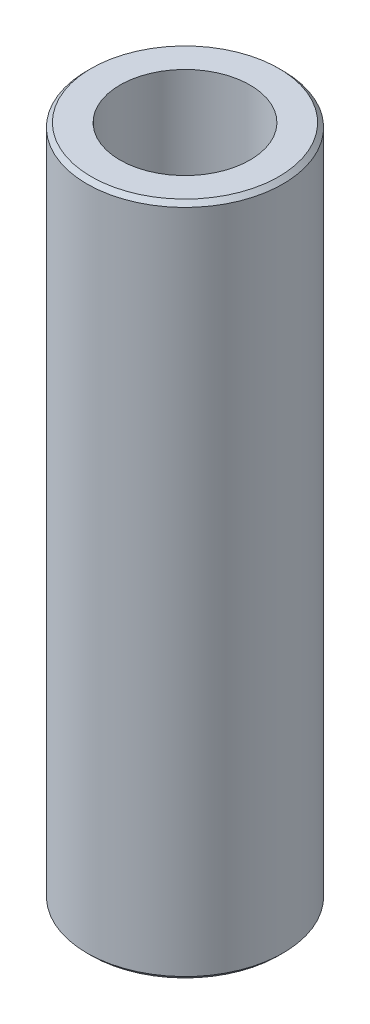
ISO-10303-21;
HEADER;
FILE_DESCRIPTION(('STEP AP214'),'2;1');
FILE_NAME('part.step','',(''),(''),'','','');
FILE_SCHEMA(('AUTOMOTIVE_DESIGN { 1 0 10303 214 1 1 1 1 }'));
ENDSEC;
DATA;
#1=APPLICATION_CONTEXT('core data for automotive mechanical design processes');
#2=APPLICATION_PROTOCOL_DEFINITION('international standard','automotive_design',2000,#1);
#3=PRODUCT_CONTEXT('',#1,'mechanical');
#4=PRODUCT('Part','Part','',(#3));
#5=PRODUCT_RELATED_PRODUCT_CATEGORY('part','',(#4));
#6=PRODUCT_DEFINITION_FORMATION('','',#4);
#7=PRODUCT_DEFINITION_CONTEXT('part definition',#1,'design');
#8=PRODUCT_DEFINITION('design','',#6,#7);
#9=PRODUCT_DEFINITION_SHAPE('','',#8);
#10=(LENGTH_UNIT() NAMED_UNIT(*) SI_UNIT(.MILLI.,.METRE.));
#11=(NAMED_UNIT(*) PLANE_ANGLE_UNIT() SI_UNIT($,.RADIAN.));
#12=(NAMED_UNIT(*) SI_UNIT($,.STERADIAN.) SOLID_ANGLE_UNIT());
#13=UNCERTAINTY_MEASURE_WITH_UNIT(LENGTH_MEASURE(1.E-05),#10,'distance_accuracy_value','');
#14=(GEOMETRIC_REPRESENTATION_CONTEXT(3) GLOBAL_UNCERTAINTY_ASSIGNED_CONTEXT((#13)) GLOBAL_UNIT_ASSIGNED_CONTEXT((#10,
#11,#12)) REPRESENTATION_CONTEXT('',''));
#15=CARTESIAN_POINT('',(0.,0.,0.));
#16=DIRECTION('',(0.,0.,1.));
#17=DIRECTION('',(1.,0.,0.));
#18=AXIS2_PLACEMENT_3D('',#15,#16,#17);
#19=CARTESIAN_POINT('',(0.,309.64632088006,0.));
#20=DIRECTION('',(0.,-1.,0.));
#21=DIRECTION('',(0.,0.,-1.));
#22=AXIS2_PLACEMENT_3D('',#19,#20,#21);
#23=CYLINDRICAL_SURFACE('',#22,45.);
#24=CARTESIAN_POINT('',(0.,307.705737566982,0.));
#25=DIRECTION('',(0.,1.,0.));
#26=DIRECTION('',(0.,0.,1.));
#27=AXIS2_PLACEMENT_3D('',#24,#25,#26);
#28=CIRCLE('',#27,45.);
#29=CARTESIAN_POINT('',(0.,307.705737566982,45.));
#30=VERTEX_POINT('',#29);
#31=EDGE_CURVE('E50',#30,#30,#28,.F.);
#32=ORIENTED_EDGE('',*,*,#31,.T.);
#33=EDGE_LOOP('',(#32));
#34=FACE_BOUND('',#33,.T.);
#35=CARTESIAN_POINT('',(0.,1.94058331307773,0.));
#36=DIRECTION('',(0.,1.,0.));
#37=DIRECTION('',(0.,0.,1.));
#38=AXIS2_PLACEMENT_3D('',#35,#36,#37);
#39=CIRCLE('',#38,45.);
#40=CARTESIAN_POINT('',(0.,1.94058331307773,45.));
#41=VERTEX_POINT('',#40);
#42=EDGE_CURVE('E51',#41,#41,#39,.T.);
#43=ORIENTED_EDGE('',*,*,#42,.T.);
#44=EDGE_LOOP('',(#43));
#45=FACE_BOUND('',#44,.T.);
#46=ADVANCED_FACE('F39',(#34,#45),#23,.T.);
#47=CARTESIAN_POINT('',(0.,309.64632088006,0.));
#48=DIRECTION('',(0.,1.,0.));
#49=DIRECTION('',(0.,0.,1.));
#50=AXIS2_PLACEMENT_3D('',#47,#48,#49);
#51=PLANE('',#50);
#52=CARTESIAN_POINT('',(0.,309.64632088006,0.));
#53=DIRECTION('',(0.,1.,0.));
#54=DIRECTION('',(0.,0.,1.));
#55=AXIS2_PLACEMENT_3D('',#52,#53,#54);
#56=CIRCLE('',#55,43.0594166869222);
#57=CARTESIAN_POINT('',(0.,309.64632088006,43.0594166869222));
#58=VERTEX_POINT('',#57);
#59=EDGE_CURVE('E54',#58,#58,#56,.T.);
#60=ORIENTED_EDGE('',*,*,#59,.T.);
#61=EDGE_LOOP('',(#60));
#62=FACE_BOUND('',#61,.T.);
#63=CARTESIAN_POINT('',(0.,309.64632088006,0.));
#64=DIRECTION('',(0.,1.,0.));
#65=DIRECTION('',(0.,0.,1.));
#66=AXIS2_PLACEMENT_3D('',#63,#64,#65);
#67=CIRCLE('',#66,29.8490769358117);
#68=CARTESIAN_POINT('',(0.,309.64632088006,29.8490769358117));
#69=VERTEX_POINT('',#68);
#70=EDGE_CURVE('E58',#69,#69,#67,.T.);
#71=ORIENTED_EDGE('',*,*,#70,.F.);
#72=EDGE_LOOP('',(#71));
#73=FACE_BOUND('',#72,.T.);
#74=ADVANCED_FACE('F69',(#62,#73),#51,.T.);
#75=CARTESIAN_POINT('',(0.,0.,0.));
#76=DIRECTION('',(0.,1.,0.));
#77=DIRECTION('',(0.,0.,1.));
#78=AXIS2_PLACEMENT_3D('',#75,#76,#77);
#79=PLANE('',#78);
#80=CARTESIAN_POINT('',(0.,0.,0.));
#81=DIRECTION('',(0.,1.,0.));
#82=DIRECTION('',(0.,0.,1.));
#83=AXIS2_PLACEMENT_3D('',#80,#81,#82);
#84=CIRCLE('',#83,43.0594166869222);
#85=CARTESIAN_POINT('',(0.,0.,43.0594166869222));
#86=VERTEX_POINT('',#85);
#87=EDGE_CURVE('E10',#86,#86,#84,.F.);
#88=ORIENTED_EDGE('',*,*,#87,.T.);
#89=EDGE_LOOP('',(#88));
#90=FACE_BOUND('',#89,.T.);
#91=CARTESIAN_POINT('',(0.,0.,0.));
#92=DIRECTION('',(0.,1.,0.));
#93=DIRECTION('',(0.,0.,1.));
#94=AXIS2_PLACEMENT_3D('',#91,#92,#93);
#95=CIRCLE('',#94,29.8490769358117);
#96=CARTESIAN_POINT('',(0.,0.,29.8490769358117));
#97=VERTEX_POINT('',#96);
#98=EDGE_CURVE('E63',#97,#97,#95,.T.);
#99=ORIENTED_EDGE('',*,*,#98,.T.);
#100=EDGE_LOOP('',(#99));
#101=FACE_BOUND('',#100,.T.);
#102=ADVANCED_FACE('F75',(#90,#101),#79,.F.);
#103=CARTESIAN_POINT('',(0.,309.64632088006,0.));
#104=DIRECTION('',(0.,-1.,0.));
#105=DIRECTION('',(0.,0.,-1.));
#106=AXIS2_PLACEMENT_3D('',#103,#104,#105);
#107=CYLINDRICAL_SURFACE('',#106,29.8490769358117);
#108=ORIENTED_EDGE('',*,*,#70,.T.);
#109=EDGE_LOOP('',(#108));
#110=FACE_BOUND('',#109,.T.);
#111=ORIENTED_EDGE('',*,*,#98,.F.);
#112=EDGE_LOOP('',(#111));
#113=FACE_BOUND('',#112,.T.);
#114=ADVANCED_FACE('F70',(#110,#113),#107,.F.);
#115=CARTESIAN_POINT('',(0.,309.64632088006,0.));
#116=DIRECTION('',(0.,-1.,0.));
#117=DIRECTION('',(0.,0.,-1.));
#118=AXIS2_PLACEMENT_3D('',#115,#116,#117);
#119=CONICAL_SURFACE('',#118,43.0594166869222,0.785398163397447);
#120=ORIENTED_EDGE('',*,*,#31,.F.);
#121=EDGE_LOOP('',(#120));
#122=FACE_BOUND('',#121,.T.);
#123=ORIENTED_EDGE('',*,*,#59,.F.);
#124=EDGE_LOOP('',(#123));
#125=FACE_BOUND('',#124,.T.);
#126=ADVANCED_FACE('F81',(#122,#125),#119,.T.);
#127=CARTESIAN_POINT('',(0.,1.94058331307773,0.));
#128=DIRECTION('',(0.,1.,0.));
#129=DIRECTION('',(0.,0.,1.));
#130=AXIS2_PLACEMENT_3D('',#127,#128,#129);
#131=CONICAL_SURFACE('',#130,45.,0.785398163397463);
#132=ORIENTED_EDGE('',*,*,#87,.F.);
#133=EDGE_LOOP('',(#132));
#134=FACE_BOUND('',#133,.T.);
#135=ORIENTED_EDGE('',*,*,#42,.F.);
#136=EDGE_LOOP('',(#135));
#137=FACE_BOUND('',#136,.T.);
#138=ADVANCED_FACE('F45',(#134,#137),#131,.T.);
#139=CLOSED_SHELL('',(#46,#74,#102,#114,#126,#138));
#140=MANIFOLD_SOLID_BREP('B2',#139);
#141=ADVANCED_BREP_SHAPE_REPRESENTATION('',(#18,#140),#14);
#142=SHAPE_DEFINITION_REPRESENTATION(#9,#141);
ENDSEC;
END-ISO-10303-21;
